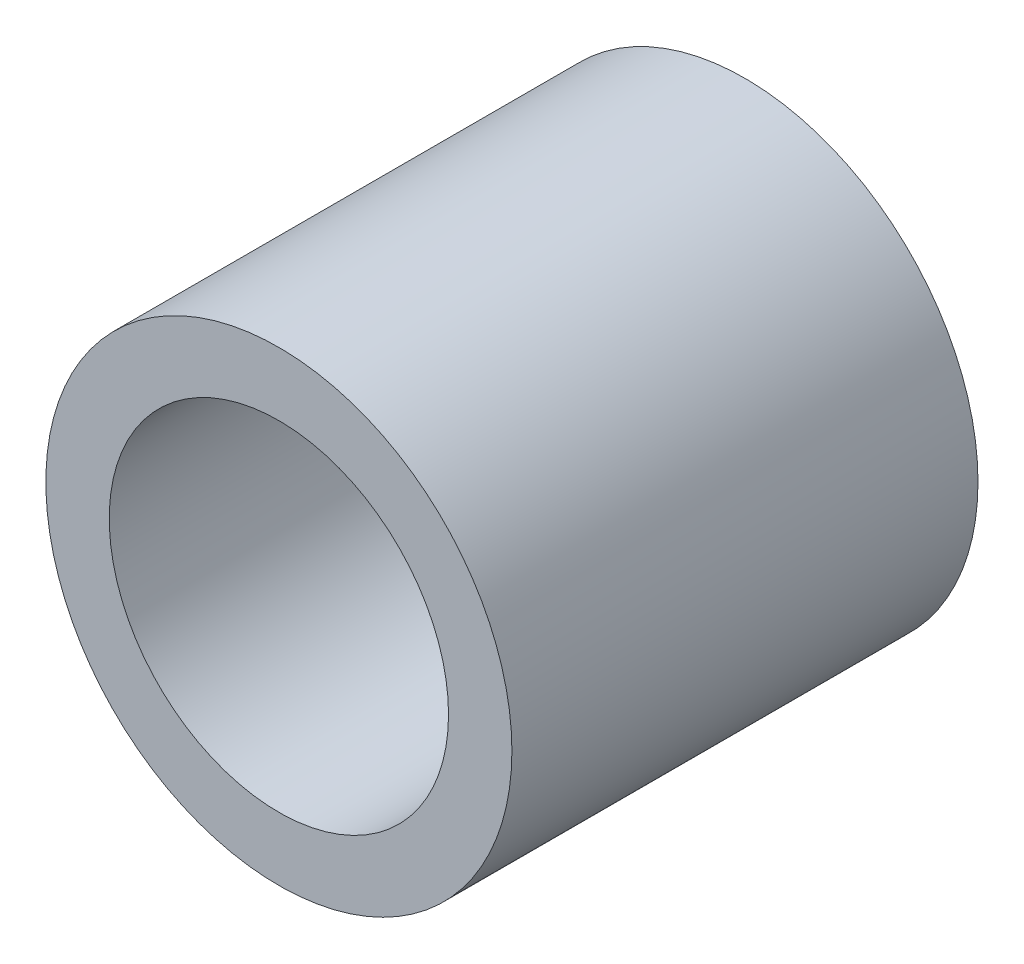
ISO-10303-21;
HEADER;
FILE_DESCRIPTION(('STEP AP214'),'2;1');
FILE_NAME('part.step','',(''),(''),'','','');
FILE_SCHEMA(('AUTOMOTIVE_DESIGN { 1 0 10303 214 1 1 1 1 }'));
ENDSEC;
DATA;
#1=APPLICATION_CONTEXT('core data for automotive mechanical design processes');
#2=APPLICATION_PROTOCOL_DEFINITION('international standard','automotive_design',2000,#1);
#3=PRODUCT_CONTEXT('',#1,'mechanical');
#4=PRODUCT('Part','Part','',(#3));
#5=PRODUCT_RELATED_PRODUCT_CATEGORY('part','',(#4));
#6=PRODUCT_DEFINITION_FORMATION('','',#4);
#7=PRODUCT_DEFINITION_CONTEXT('part definition',#1,'design');
#8=PRODUCT_DEFINITION('design','',#6,#7);
#9=PRODUCT_DEFINITION_SHAPE('','',#8);
#10=(LENGTH_UNIT() NAMED_UNIT(*) SI_UNIT(.MILLI.,.METRE.));
#11=(NAMED_UNIT(*) PLANE_ANGLE_UNIT() SI_UNIT($,.RADIAN.));
#12=(NAMED_UNIT(*) SI_UNIT($,.STERADIAN.) SOLID_ANGLE_UNIT());
#13=UNCERTAINTY_MEASURE_WITH_UNIT(LENGTH_MEASURE(1.E-05),#10,'distance_accuracy_value','');
#14=(GEOMETRIC_REPRESENTATION_CONTEXT(3) GLOBAL_UNCERTAINTY_ASSIGNED_CONTEXT((#13)) GLOBAL_UNIT_ASSIGNED_CONTEXT((#10,
#11,#12)) REPRESENTATION_CONTEXT('',''));
#15=CARTESIAN_POINT('',(0.,0.,0.));
#16=DIRECTION('',(0.,0.,1.));
#17=DIRECTION('',(1.,0.,0.));
#18=AXIS2_PLACEMENT_3D('',#15,#16,#17);
#19=CARTESIAN_POINT('',(0.,0.,40.));
#20=DIRECTION('',(0.,0.,-1.));
#21=DIRECTION('',(-1.,0.,0.));
#22=AXIS2_PLACEMENT_3D('',#19,#20,#21);
#23=CYLINDRICAL_SURFACE('',#22,12.5);
#24=CARTESIAN_POINT('',(0.,0.,0.));
#25=DIRECTION('',(0.,0.,1.));
#26=DIRECTION('',(1.,0.,0.));
#27=AXIS2_PLACEMENT_3D('',#24,#25,#26);
#28=CIRCLE('',#27,12.5);
#29=CARTESIAN_POINT('',(12.5,0.,0.));
#30=VERTEX_POINT('',#29);
#31=EDGE_CURVE('E11',#30,#30,#28,.T.);
#32=ORIENTED_EDGE('',*,*,#31,.T.);
#33=EDGE_LOOP('',(#32));
#34=FACE_BOUND('',#33,.T.);
#35=CARTESIAN_POINT('',(0.,0.,25.));
#36=DIRECTION('',(0.,0.,1.));
#37=DIRECTION('',(1.,0.,0.));
#38=AXIS2_PLACEMENT_3D('',#35,#36,#37);
#39=CIRCLE('',#38,12.5);
#40=CARTESIAN_POINT('',(12.5,0.,25.));
#41=VERTEX_POINT('',#40);
#42=EDGE_CURVE('E46',#41,#41,#39,.T.);
#43=ORIENTED_EDGE('',*,*,#42,.F.);
#44=EDGE_LOOP('',(#43));
#45=FACE_BOUND('',#44,.T.);
#46=ADVANCED_FACE('F43',(#34,#45),#23,.T.);
#47=CARTESIAN_POINT('',(0.,0.,0.));
#48=DIRECTION('',(0.,0.,1.));
#49=DIRECTION('',(1.,0.,0.));
#50=AXIS2_PLACEMENT_3D('',#47,#48,#49);
#51=PLANE('',#50);
#52=DIRECTION('',(-1.,0.,0.));
#53=VECTOR('',#52,1.);
#54=CARTESIAN_POINT('',(2.6,-1.6,0.));
#55=LINE('',#54,#53);
#56=CARTESIAN_POINT('',(2.6,-1.6,0.));
#57=VERTEX_POINT('',#56);
#58=CARTESIAN_POINT('',(-2.6,-1.6,0.));
#59=VERTEX_POINT('',#58);
#60=EDGE_CURVE('E93',#57,#59,#55,.T.);
#61=ORIENTED_EDGE('',*,*,#60,.F.);
#62=DIRECTION('',(0.,-1.,0.));
#63=VECTOR('',#62,1.);
#64=CARTESIAN_POINT('',(2.6,1.6,0.));
#65=LINE('',#64,#63);
#66=CARTESIAN_POINT('',(2.6,1.6,0.));
#67=VERTEX_POINT('',#66);
#68=EDGE_CURVE('E58',#67,#57,#65,.T.);
#69=ORIENTED_EDGE('',*,*,#68,.F.);
#70=DIRECTION('',(1.,0.,0.));
#71=VECTOR('',#70,1.);
#72=CARTESIAN_POINT('',(2.6,1.6,0.));
#73=LINE('',#72,#71);
#74=CARTESIAN_POINT('',(-2.6,1.6,0.));
#75=VERTEX_POINT('',#74);
#76=EDGE_CURVE('E113',#75,#67,#73,.T.);
#77=ORIENTED_EDGE('',*,*,#76,.F.);
#78=DIRECTION('',(0.,1.,0.));
#79=VECTOR('',#78,1.);
#80=CARTESIAN_POINT('',(-2.6,1.6,0.));
#81=LINE('',#80,#79);
#82=EDGE_CURVE('E124',#59,#75,#81,.T.);
#83=ORIENTED_EDGE('',*,*,#82,.F.);
#84=EDGE_LOOP('',(#61,#69,#77,#83));
#85=FACE_BOUND('',#84,.T.);
#86=ORIENTED_EDGE('',*,*,#31,.F.);
#87=EDGE_LOOP('',(#86));
#88=FACE_BOUND('',#87,.T.);
#89=ADVANCED_FACE('F135',(#85,#88),#51,.F.);
#90=CARTESIAN_POINT('',(0.,0.,25.));
#91=DIRECTION('',(0.,0.,1.));
#92=DIRECTION('',(1.,0.,0.));
#93=AXIS2_PLACEMENT_3D('',#90,#91,#92);
#94=PLANE('',#93);
#95=CARTESIAN_POINT('',(0.,0.,25.));
#96=DIRECTION('',(0.,0.,1.));
#97=DIRECTION('',(1.,0.,0.));
#98=AXIS2_PLACEMENT_3D('',#95,#96,#97);
#99=CIRCLE('',#98,9.1);
#100=CARTESIAN_POINT('',(9.1,0.,25.));
#101=VERTEX_POINT('',#100);
#102=EDGE_CURVE('E187',#101,#101,#99,.T.);
#103=ORIENTED_EDGE('',*,*,#102,.F.);
#104=EDGE_LOOP('',(#103));
#105=FACE_BOUND('',#104,.T.);
#106=ORIENTED_EDGE('',*,*,#42,.T.);
#107=EDGE_LOOP('',(#106));
#108=FACE_BOUND('',#107,.T.);
#109=ADVANCED_FACE('F147',(#105,#108),#94,.T.);
#110=CARTESIAN_POINT('',(2.6,1.6,7.));
#111=DIRECTION('',(1.,0.,0.));
#112=DIRECTION('',(0.,1.,0.));
#113=AXIS2_PLACEMENT_3D('',#110,#111,#112);
#114=PLANE('',#113);
#115=ORIENTED_EDGE('',*,*,#68,.T.);
#116=DIRECTION('',(0.,0.,-1.));
#117=VECTOR('',#116,1.);
#118=CARTESIAN_POINT('',(2.6,-1.6,7.));
#119=LINE('',#118,#117);
#120=CARTESIAN_POINT('',(2.6,-1.6,7.));
#121=VERTEX_POINT('',#120);
#122=EDGE_CURVE('E81',#121,#57,#119,.T.);
#123=ORIENTED_EDGE('',*,*,#122,.F.);
#124=DIRECTION('',(0.,-1.,0.));
#125=VECTOR('',#124,1.);
#126=CARTESIAN_POINT('',(2.6,1.6,7.));
#127=LINE('',#126,#125);
#128=CARTESIAN_POINT('',(2.6,1.6,7.));
#129=VERTEX_POINT('',#128);
#130=EDGE_CURVE('E109',#129,#121,#127,.T.);
#131=ORIENTED_EDGE('',*,*,#130,.F.);
#132=DIRECTION('',(0.,0.,-1.));
#133=VECTOR('',#132,1.);
#134=CARTESIAN_POINT('',(2.6,1.6,7.));
#135=LINE('',#134,#133);
#136=EDGE_CURVE('E66',#129,#67,#135,.T.);
#137=ORIENTED_EDGE('',*,*,#136,.T.);
#138=EDGE_LOOP('',(#115,#123,#131,#137));
#139=FACE_BOUND('',#138,.T.);
#140=ADVANCED_FACE('F140',(#139),#114,.F.);
#141=CARTESIAN_POINT('',(2.6,1.6,7.));
#142=DIRECTION('',(0.,1.,0.));
#143=DIRECTION('',(0.,0.,1.));
#144=AXIS2_PLACEMENT_3D('',#141,#142,#143);
#145=PLANE('',#144);
#146=ORIENTED_EDGE('',*,*,#76,.T.);
#147=ORIENTED_EDGE('',*,*,#136,.F.);
#148=DIRECTION('',(1.,0.,0.));
#149=VECTOR('',#148,1.);
#150=CARTESIAN_POINT('',(2.6,1.6,7.));
#151=LINE('',#150,#149);
#152=CARTESIAN_POINT('',(-2.6,1.6,7.));
#153=VERTEX_POINT('',#152);
#154=EDGE_CURVE('E106',#153,#129,#151,.T.);
#155=ORIENTED_EDGE('',*,*,#154,.F.);
#156=DIRECTION('',(0.,0.,-1.));
#157=VECTOR('',#156,1.);
#158=CARTESIAN_POINT('',(-2.6,1.6,7.));
#159=LINE('',#158,#157);
#160=EDGE_CURVE('E98',#153,#75,#159,.T.);
#161=ORIENTED_EDGE('',*,*,#160,.T.);
#162=EDGE_LOOP('',(#146,#147,#155,#161));
#163=FACE_BOUND('',#162,.T.);
#164=ADVANCED_FACE('F138',(#163),#145,.F.);
#165=CARTESIAN_POINT('',(-2.6,1.6,7.));
#166=DIRECTION('',(-1.,0.,0.));
#167=DIRECTION('',(0.,0.,1.));
#168=AXIS2_PLACEMENT_3D('',#165,#166,#167);
#169=PLANE('',#168);
#170=ORIENTED_EDGE('',*,*,#82,.T.);
#171=ORIENTED_EDGE('',*,*,#160,.F.);
#172=DIRECTION('',(0.,1.,0.));
#173=VECTOR('',#172,1.);
#174=CARTESIAN_POINT('',(-2.6,1.6,7.));
#175=LINE('',#174,#173);
#176=CARTESIAN_POINT('',(-2.6,-1.6,7.));
#177=VERTEX_POINT('',#176);
#178=EDGE_CURVE('E101',#177,#153,#175,.T.);
#179=ORIENTED_EDGE('',*,*,#178,.F.);
#180=DIRECTION('',(0.,0.,-1.));
#181=VECTOR('',#180,1.);
#182=CARTESIAN_POINT('',(-2.6,-1.6,7.));
#183=LINE('',#182,#181);
#184=EDGE_CURVE('E86',#177,#59,#183,.T.);
#185=ORIENTED_EDGE('',*,*,#184,.T.);
#186=EDGE_LOOP('',(#170,#171,#179,#185));
#187=FACE_BOUND('',#186,.T.);
#188=ADVANCED_FACE('F102',(#187),#169,.F.);
#189=CARTESIAN_POINT('',(2.6,-1.6,7.));
#190=DIRECTION('',(0.,-1.,0.));
#191=DIRECTION('',(0.,0.,-1.));
#192=AXIS2_PLACEMENT_3D('',#189,#190,#191);
#193=PLANE('',#192);
#194=ORIENTED_EDGE('',*,*,#60,.T.);
#195=ORIENTED_EDGE('',*,*,#184,.F.);
#196=DIRECTION('',(-1.,0.,0.));
#197=VECTOR('',#196,1.);
#198=CARTESIAN_POINT('',(2.6,-1.6,7.));
#199=LINE('',#198,#197);
#200=EDGE_CURVE('E90',#121,#177,#199,.T.);
#201=ORIENTED_EDGE('',*,*,#200,.F.);
#202=ORIENTED_EDGE('',*,*,#122,.T.);
#203=EDGE_LOOP('',(#194,#195,#201,#202));
#204=FACE_BOUND('',#203,.T.);
#205=ADVANCED_FACE('F88',(#204),#193,.F.);
#206=CARTESIAN_POINT('',(0.,0.,7.));
#207=DIRECTION('',(0.,0.,-1.));
#208=DIRECTION('',(-1.,0.,0.));
#209=AXIS2_PLACEMENT_3D('',#206,#207,#208);
#210=PLANE('',#209);
#211=ORIENTED_EDGE('',*,*,#130,.T.);
#212=ORIENTED_EDGE('',*,*,#200,.T.);
#213=ORIENTED_EDGE('',*,*,#178,.T.);
#214=ORIENTED_EDGE('',*,*,#154,.T.);
#215=EDGE_LOOP('',(#211,#212,#213,#214));
#216=FACE_BOUND('',#215,.T.);
#217=ADVANCED_FACE('F108',(#216),#210,.T.);
#218=CARTESIAN_POINT('',(0.,0.,10.));
#219=DIRECTION('',(0.,0.,1.));
#220=DIRECTION('',(1.,0.,0.));
#221=AXIS2_PLACEMENT_3D('',#218,#219,#220);
#222=CYLINDRICAL_SURFACE('',#221,9.1);
#223=CARTESIAN_POINT('',(0.,0.,10.));
#224=DIRECTION('',(0.,0.,1.));
#225=DIRECTION('',(1.,0.,0.));
#226=AXIS2_PLACEMENT_3D('',#223,#224,#225);
#227=CIRCLE('',#226,9.1);
#228=CARTESIAN_POINT('',(9.1,0.,10.));
#229=VERTEX_POINT('',#228);
#230=EDGE_CURVE('E121',#229,#229,#227,.T.);
#231=ORIENTED_EDGE('',*,*,#230,.F.);
#232=EDGE_LOOP('',(#231));
#233=FACE_BOUND('',#232,.T.);
#234=ORIENTED_EDGE('',*,*,#102,.T.);
#235=EDGE_LOOP('',(#234));
#236=FACE_BOUND('',#235,.T.);
#237=ADVANCED_FACE('F172',(#233,#236),#222,.F.);
#238=CARTESIAN_POINT('',(0.,0.,10.));
#239=DIRECTION('',(0.,0.,1.));
#240=DIRECTION('',(1.,0.,0.));
#241=AXIS2_PLACEMENT_3D('',#238,#239,#240);
#242=PLANE('',#241);
#243=ORIENTED_EDGE('',*,*,#230,.T.);
#244=EDGE_LOOP('',(#243));
#245=FACE_BOUND('',#244,.T.);
#246=ADVANCED_FACE('F176',(#245),#242,.T.);
#247=CLOSED_SHELL('',(#46,#89,#109,#140,#164,#188,#205,#217,#237,#246));
#248=MANIFOLD_SOLID_BREP('B2',#247);
#249=ADVANCED_BREP_SHAPE_REPRESENTATION('',(#18,#248),#14);
#250=SHAPE_DEFINITION_REPRESENTATION(#9,#249);
ENDSEC;
END-ISO-10303-21;
